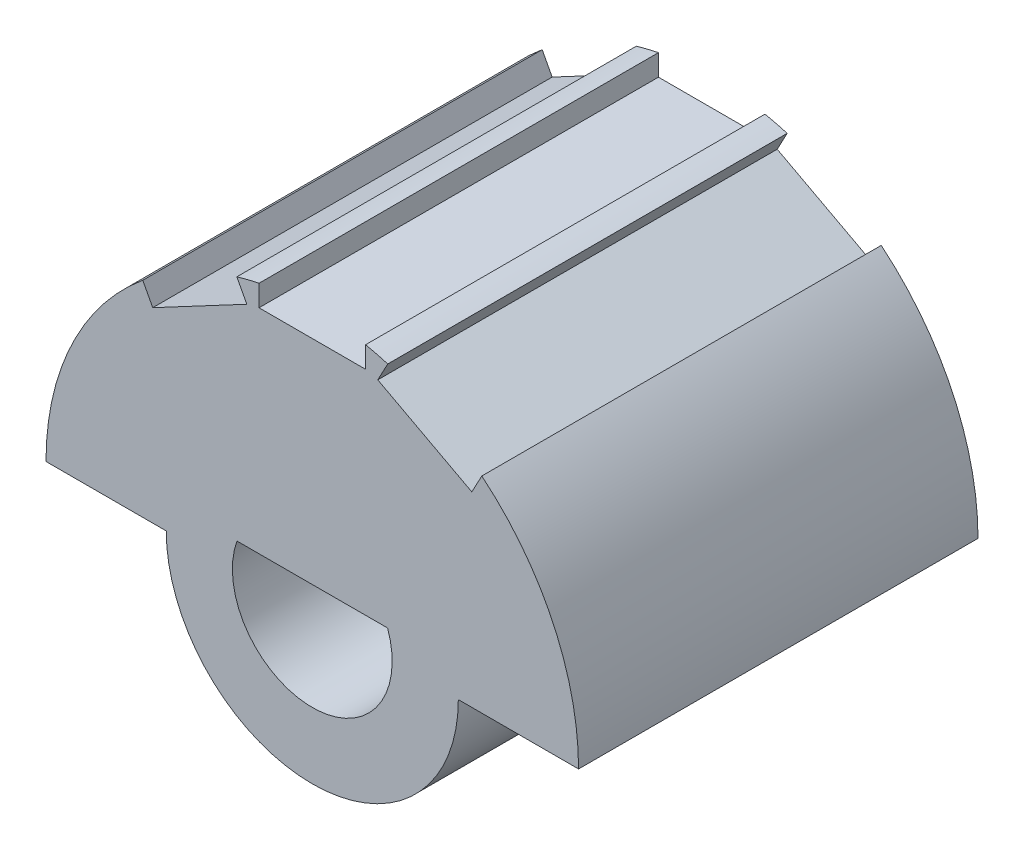
ISO-10303-21;
HEADER;
FILE_DESCRIPTION(('STEP AP214'),'2;1');
FILE_NAME('part.step','',(''),(''),'','','');
FILE_SCHEMA(('AUTOMOTIVE_DESIGN { 1 0 10303 214 1 1 1 1 }'));
ENDSEC;
DATA;
#1=APPLICATION_CONTEXT('core data for automotive mechanical design processes');
#2=APPLICATION_PROTOCOL_DEFINITION('international standard','automotive_design',2000,#1);
#3=PRODUCT_CONTEXT('',#1,'mechanical');
#4=PRODUCT('Part','Part','',(#3));
#5=PRODUCT_RELATED_PRODUCT_CATEGORY('part','',(#4));
#6=PRODUCT_DEFINITION_FORMATION('','',#4);
#7=PRODUCT_DEFINITION_CONTEXT('part definition',#1,'design');
#8=PRODUCT_DEFINITION('design','',#6,#7);
#9=PRODUCT_DEFINITION_SHAPE('','',#8);
#10=(LENGTH_UNIT() NAMED_UNIT(*) SI_UNIT(.MILLI.,.METRE.));
#11=(NAMED_UNIT(*) PLANE_ANGLE_UNIT() SI_UNIT($,.RADIAN.));
#12=(NAMED_UNIT(*) SI_UNIT($,.STERADIAN.) SOLID_ANGLE_UNIT());
#13=UNCERTAINTY_MEASURE_WITH_UNIT(LENGTH_MEASURE(1.E-05),#10,'distance_accuracy_value','');
#14=(GEOMETRIC_REPRESENTATION_CONTEXT(3) GLOBAL_UNCERTAINTY_ASSIGNED_CONTEXT((#13)) GLOBAL_UNIT_ASSIGNED_CONTEXT((#10,
#11,#12)) REPRESENTATION_CONTEXT('',''));
#15=CARTESIAN_POINT('',(0.,0.,0.));
#16=DIRECTION('',(0.,0.,1.));
#17=DIRECTION('',(1.,0.,0.));
#18=AXIS2_PLACEMENT_3D('',#15,#16,#17);
#19=CARTESIAN_POINT('',(0.,0.,0.));
#20=DIRECTION('',(0.,0.,1.));
#21=DIRECTION('',(1.,0.,0.));
#22=AXIS2_PLACEMENT_3D('',#19,#20,#21);
#23=CYLINDRICAL_SURFACE('',#22,10.);
#24=DIRECTION('',(0.,0.,1.));
#25=VECTOR('',#24,1.);
#26=CARTESIAN_POINT('',(2.83396792457184,9.59002741406395,0.));
#27=LINE('',#26,#25);
#28=CARTESIAN_POINT('',(2.83396792457184,9.59002741406394,15.));
#29=VERTEX_POINT('',#28);
#30=CARTESIAN_POINT('',(2.83396792457184,9.59002741406394,0.));
#31=VERTEX_POINT('',#30);
#32=EDGE_CURVE('E169',#29,#31,#27,.F.);
#33=ORIENTED_EDGE('',*,*,#32,.T.);
#34=CARTESIAN_POINT('',(0.,0.,0.));
#35=DIRECTION('',(0.,0.,1.));
#36=DIRECTION('',(1.,0.,0.));
#37=AXIS2_PLACEMENT_3D('',#34,#35,#36);
#38=CIRCLE('',#37,10.);
#39=CARTESIAN_POINT('',(2.,9.79795897113271,0.));
#40=VERTEX_POINT('',#39);
#41=EDGE_CURVE('E123',#31,#40,#38,.T.);
#42=ORIENTED_EDGE('',*,*,#41,.T.);
#43=DIRECTION('',(0.,0.,1.));
#44=VECTOR('',#43,1.);
#45=CARTESIAN_POINT('',(2.,9.79795897113271,0.));
#46=LINE('',#45,#44);
#47=CARTESIAN_POINT('',(2.,9.79795897113271,15.));
#48=VERTEX_POINT('',#47);
#49=EDGE_CURVE('E126',#40,#48,#46,.T.);
#50=ORIENTED_EDGE('',*,*,#49,.T.);
#51=CARTESIAN_POINT('',(0.,0.,15.));
#52=DIRECTION('',(0.,0.,1.));
#53=DIRECTION('',(1.,0.,0.));
#54=AXIS2_PLACEMENT_3D('',#51,#52,#53);
#55=CIRCLE('',#54,10.);
#56=EDGE_CURVE('E20',#48,#29,#55,.F.);
#57=ORIENTED_EDGE('',*,*,#56,.T.);
#58=EDGE_LOOP('',(#33,#42,#50,#57));
#59=FACE_BOUND('',#58,.T.);
#60=ADVANCED_FACE('F17',(#59),#23,.T.);
#61=CARTESIAN_POINT('',(0.,0.,0.));
#62=DIRECTION('',(0.,0.,1.));
#63=DIRECTION('',(1.,0.,0.));
#64=AXIS2_PLACEMENT_3D('',#61,#62,#63);
#65=CYLINDRICAL_SURFACE('',#64,10.);
#66=DIRECTION('',(0.,0.,1.));
#67=VECTOR('',#66,1.);
#68=CARTESIAN_POINT('',(-2.83396792457185,9.59002741406394,0.));
#69=LINE('',#68,#67);
#70=CARTESIAN_POINT('',(-2.83396792457185,9.59002741406394,0.));
#71=VERTEX_POINT('',#70);
#72=CARTESIAN_POINT('',(-2.83396792457185,9.59002741406394,15.));
#73=VERTEX_POINT('',#72);
#74=EDGE_CURVE('E222',#71,#73,#69,.T.);
#75=ORIENTED_EDGE('',*,*,#74,.T.);
#76=CARTESIAN_POINT('',(0.,0.,15.));
#77=DIRECTION('',(0.,0.,1.));
#78=DIRECTION('',(1.,0.,0.));
#79=AXIS2_PLACEMENT_3D('',#76,#77,#78);
#80=CIRCLE('',#79,10.);
#81=CARTESIAN_POINT('',(-2.,9.79795897113271,15.));
#82=VERTEX_POINT('',#81);
#83=EDGE_CURVE('E182',#73,#82,#80,.F.);
#84=ORIENTED_EDGE('',*,*,#83,.T.);
#85=DIRECTION('',(0.,0.,1.));
#86=VECTOR('',#85,1.);
#87=CARTESIAN_POINT('',(-2.,9.79795897113272,0.));
#88=LINE('',#87,#86);
#89=CARTESIAN_POINT('',(-2.,9.79795897113271,0.));
#90=VERTEX_POINT('',#89);
#91=EDGE_CURVE('E140',#82,#90,#88,.F.);
#92=ORIENTED_EDGE('',*,*,#91,.T.);
#93=CARTESIAN_POINT('',(0.,0.,0.));
#94=DIRECTION('',(0.,0.,1.));
#95=DIRECTION('',(1.,0.,0.));
#96=AXIS2_PLACEMENT_3D('',#93,#94,#95);
#97=CIRCLE('',#96,10.);
#98=EDGE_CURVE('E216',#90,#71,#97,.T.);
#99=ORIENTED_EDGE('',*,*,#98,.T.);
#100=EDGE_LOOP('',(#75,#84,#92,#99));
#101=FACE_BOUND('',#100,.T.);
#102=ADVANCED_FACE('F221',(#101),#65,.T.);
#103=CARTESIAN_POINT('',(3.2021736247616,10.2825216191022,0.));
#104=DIRECTION('',(-0.882947592858927,0.469471562785891,0.));
#105=DIRECTION('',(-0.469471562785891,-0.882947592858927,0.));
#106=AXIS2_PLACEMENT_3D('',#103,#104,#105);
#107=PLANE('',#106);
#108=DIRECTION('',(-0.469471562785891,-0.882947592858927,0.));
#109=VECTOR('',#108,1.);
#110=CARTESIAN_POINT('',(3.2021736247616,10.2825216191022,0.));
#111=LINE('',#110,#109);
#112=CARTESIAN_POINT('',(2.45934887935515,8.88547146130213,0.));
#113=VERTEX_POINT('',#112);
#114=EDGE_CURVE('E166',#31,#113,#111,.T.);
#115=ORIENTED_EDGE('',*,*,#114,.F.);
#116=ORIENTED_EDGE('',*,*,#32,.F.);
#117=DIRECTION('',(-0.469471562785891,-0.882947592858927,0.));
#118=VECTOR('',#117,1.);
#119=CARTESIAN_POINT('',(3.2021736247616,10.2825216191022,15.));
#120=LINE('',#119,#118);
#121=CARTESIAN_POINT('',(2.45934887935515,8.88547146130213,15.));
#122=VERTEX_POINT('',#121);
#123=EDGE_CURVE('E119',#122,#29,#120,.F.);
#124=ORIENTED_EDGE('',*,*,#123,.F.);
#125=DIRECTION('',(0.,0.,1.));
#126=VECTOR('',#125,1.);
#127=CARTESIAN_POINT('',(2.45934887935515,8.88547146130213,0.));
#128=LINE('',#127,#126);
#129=EDGE_CURVE('E175',#122,#113,#128,.F.);
#130=ORIENTED_EDGE('',*,*,#129,.T.);
#131=EDGE_LOOP('',(#115,#116,#124,#130));
#132=FACE_BOUND('',#131,.T.);
#133=ADVANCED_FACE('F370',(#132),#107,.F.);
#134=CARTESIAN_POINT('',(-2.,10.5822571680347,0.));
#135=DIRECTION('',(-1.,0.,0.));
#136=DIRECTION('',(0.,-1.,0.));
#137=AXIS2_PLACEMENT_3D('',#134,#135,#136);
#138=PLANE('',#137);
#139=DIRECTION('',(0.,-1.,0.));
#140=VECTOR('',#139,1.);
#141=CARTESIAN_POINT('',(-2.,10.5822571680347,0.));
#142=LINE('',#141,#140);
#143=CARTESIAN_POINT('',(-2.,9.,0.));
#144=VERTEX_POINT('',#143);
#145=EDGE_CURVE('E136',#90,#144,#142,.T.);
#146=ORIENTED_EDGE('',*,*,#145,.F.);
#147=ORIENTED_EDGE('',*,*,#91,.F.);
#148=DIRECTION('',(0.,-1.,0.));
#149=VECTOR('',#148,1.);
#150=CARTESIAN_POINT('',(-2.,10.5822571680347,15.));
#151=LINE('',#150,#149);
#152=CARTESIAN_POINT('',(-2.,9.,15.));
#153=VERTEX_POINT('',#152);
#154=EDGE_CURVE('E155',#153,#82,#151,.F.);
#155=ORIENTED_EDGE('',*,*,#154,.F.);
#156=DIRECTION('',(0.,0.,-1.));
#157=VECTOR('',#156,1.);
#158=CARTESIAN_POINT('',(-2.,9.,0.));
#159=LINE('',#158,#157);
#160=EDGE_CURVE('E159',#153,#144,#159,.T.);
#161=ORIENTED_EDGE('',*,*,#160,.T.);
#162=EDGE_LOOP('',(#146,#147,#155,#161));
#163=FACE_BOUND('',#162,.T.);
#164=ADVANCED_FACE('F373',(#163),#138,.F.);
#165=CARTESIAN_POINT('',(2.,9.,0.));
#166=DIRECTION('',(1.,0.,0.));
#167=DIRECTION('',(0.,1.,0.));
#168=AXIS2_PLACEMENT_3D('',#165,#166,#167);
#169=PLANE('',#168);
#170=DIRECTION('',(0.,1.,0.));
#171=VECTOR('',#170,1.);
#172=CARTESIAN_POINT('',(2.,9.,0.));
#173=LINE('',#172,#171);
#174=CARTESIAN_POINT('',(2.,9.,0.));
#175=VERTEX_POINT('',#174);
#176=EDGE_CURVE('E130',#175,#40,#173,.T.);
#177=ORIENTED_EDGE('',*,*,#176,.F.);
#178=DIRECTION('',(0.,0.,-1.));
#179=VECTOR('',#178,1.);
#180=CARTESIAN_POINT('',(2.,9.,0.));
#181=LINE('',#180,#179);
#182=CARTESIAN_POINT('',(2.,9.,15.));
#183=VERTEX_POINT('',#182);
#184=EDGE_CURVE('E134',#175,#183,#181,.F.);
#185=ORIENTED_EDGE('',*,*,#184,.T.);
#186=DIRECTION('',(0.,1.,0.));
#187=VECTOR('',#186,1.);
#188=CARTESIAN_POINT('',(2.,9.,15.));
#189=LINE('',#188,#187);
#190=EDGE_CURVE('E115',#48,#183,#189,.F.);
#191=ORIENTED_EDGE('',*,*,#190,.F.);
#192=ORIENTED_EDGE('',*,*,#49,.F.);
#193=EDGE_LOOP('',(#177,#185,#191,#192));
#194=FACE_BOUND('',#193,.T.);
#195=ADVANCED_FACE('F132',(#194),#169,.F.);
#196=CARTESIAN_POINT('',(-2.45934887935516,8.88547146130213,0.));
#197=DIRECTION('',(0.882947592858927,0.469471562785891,0.));
#198=DIRECTION('',(-0.469471562785891,0.882947592858927,0.));
#199=AXIS2_PLACEMENT_3D('',#196,#197,#198);
#200=PLANE('',#199);
#201=DIRECTION('',(-0.469471562785891,0.882947592858927,0.));
#202=VECTOR('',#201,1.);
#203=CARTESIAN_POINT('',(-2.45934887935516,8.88547146130213,0.));
#204=LINE('',#203,#202);
#205=CARTESIAN_POINT('',(-2.45934887935516,8.88547146130213,0.));
#206=VERTEX_POINT('',#205);
#207=EDGE_CURVE('E231',#206,#71,#204,.T.);
#208=ORIENTED_EDGE('',*,*,#207,.F.);
#209=DIRECTION('',(0.,0.,1.));
#210=VECTOR('',#209,1.);
#211=CARTESIAN_POINT('',(-2.45934887935516,8.88547146130213,0.));
#212=LINE('',#211,#210);
#213=CARTESIAN_POINT('',(-2.45934887935516,8.88547146130213,15.));
#214=VERTEX_POINT('',#213);
#215=EDGE_CURVE('E242',#206,#214,#212,.T.);
#216=ORIENTED_EDGE('',*,*,#215,.T.);
#217=DIRECTION('',(-0.469471562785891,0.882947592858927,0.));
#218=VECTOR('',#217,1.);
#219=CARTESIAN_POINT('',(-2.45934887935516,8.88547146130213,15.));
#220=LINE('',#219,#218);
#221=EDGE_CURVE('E129',#73,#214,#220,.F.);
#222=ORIENTED_EDGE('',*,*,#221,.F.);
#223=ORIENTED_EDGE('',*,*,#74,.F.);
#224=EDGE_LOOP('',(#208,#216,#222,#223));
#225=FACE_BOUND('',#224,.T.);
#226=ADVANCED_FACE('F228',(#225),#200,.F.);
#227=CARTESIAN_POINT('',(-6.73396399619731,8.4046353679586,0.));
#228=DIRECTION('',(-0.882947592858927,-0.46947156278589,0.));
#229=DIRECTION('',(0.46947156278589,-0.882947592858927,0.));
#230=AXIS2_PLACEMENT_3D('',#227,#228,#229);
#231=PLANE('',#230);
#232=DIRECTION('',(0.46947156278589,-0.882947592858927,0.));
#233=VECTOR('',#232,1.);
#234=CARTESIAN_POINT('',(-6.73396399619731,8.4046353679586,0.));
#235=LINE('',#234,#233);
#236=CARTESIAN_POINT('',(-6.36575829600757,7.71214116292038,0.));
#237=VERTEX_POINT('',#236);
#238=CARTESIAN_POINT('',(-5.99113925079087,7.00758521015856,0.));
#239=VERTEX_POINT('',#238);
#240=EDGE_CURVE('E236',#237,#239,#235,.T.);
#241=ORIENTED_EDGE('',*,*,#240,.F.);
#242=DIRECTION('',(0.,0.,1.));
#243=VECTOR('',#242,1.);
#244=CARTESIAN_POINT('',(-6.36575829600757,7.71214116292038,0.));
#245=LINE('',#244,#243);
#246=CARTESIAN_POINT('',(-6.36575829600757,7.71214116292038,15.));
#247=VERTEX_POINT('',#246);
#248=EDGE_CURVE('E244',#247,#237,#245,.F.);
#249=ORIENTED_EDGE('',*,*,#248,.F.);
#250=DIRECTION('',(0.46947156278589,-0.882947592858927,0.));
#251=VECTOR('',#250,1.);
#252=CARTESIAN_POINT('',(-6.73396399619731,8.4046353679586,15.));
#253=LINE('',#252,#251);
#254=CARTESIAN_POINT('',(-5.99113925079087,7.00758521015856,15.));
#255=VERTEX_POINT('',#254);
#256=EDGE_CURVE('E234',#255,#247,#253,.F.);
#257=ORIENTED_EDGE('',*,*,#256,.F.);
#258=DIRECTION('',(0.,0.,1.));
#259=VECTOR('',#258,1.);
#260=CARTESIAN_POINT('',(-5.99113925079087,7.00758521015856,0.));
#261=LINE('',#260,#259);
#262=EDGE_CURVE('E245',#255,#239,#261,.F.);
#263=ORIENTED_EDGE('',*,*,#262,.T.);
#264=EDGE_LOOP('',(#241,#249,#257,#263));
#265=FACE_BOUND('',#264,.T.);
#266=ADVANCED_FACE('F323',(#265),#231,.F.);
#267=CARTESIAN_POINT('',(5.99113925079087,7.00758521015856,0.));
#268=DIRECTION('',(0.882947592858927,-0.469471562785891,0.));
#269=DIRECTION('',(0.469471562785891,0.882947592858927,0.));
#270=AXIS2_PLACEMENT_3D('',#267,#268,#269);
#271=PLANE('',#270);
#272=DIRECTION('',(0.469471562785891,0.882947592858927,0.));
#273=VECTOR('',#272,1.);
#274=CARTESIAN_POINT('',(5.99113925079087,7.00758521015856,0.));
#275=LINE('',#274,#273);
#276=CARTESIAN_POINT('',(5.99113925079087,7.00758521015856,0.));
#277=VERTEX_POINT('',#276);
#278=CARTESIAN_POINT('',(6.36575829600757,7.71214116292037,0.));
#279=VERTEX_POINT('',#278);
#280=EDGE_CURVE('E351',#277,#279,#275,.T.);
#281=ORIENTED_EDGE('',*,*,#280,.F.);
#282=DIRECTION('',(0.,0.,1.));
#283=VECTOR('',#282,1.);
#284=CARTESIAN_POINT('',(5.99113925079087,7.00758521015856,0.));
#285=LINE('',#284,#283);
#286=CARTESIAN_POINT('',(5.99113925079087,7.00758521015856,15.));
#287=VERTEX_POINT('',#286);
#288=EDGE_CURVE('E162',#277,#287,#285,.T.);
#289=ORIENTED_EDGE('',*,*,#288,.T.);
#290=DIRECTION('',(0.469471562785891,0.882947592858927,0.));
#291=VECTOR('',#290,1.);
#292=CARTESIAN_POINT('',(5.99113925079087,7.00758521015856,15.));
#293=LINE('',#292,#291);
#294=CARTESIAN_POINT('',(6.36575829600757,7.71214116292037,15.));
#295=VERTEX_POINT('',#294);
#296=EDGE_CURVE('E311',#295,#287,#293,.F.);
#297=ORIENTED_EDGE('',*,*,#296,.F.);
#298=DIRECTION('',(0.,0.,1.));
#299=VECTOR('',#298,1.);
#300=CARTESIAN_POINT('',(6.36575829600757,7.71214116292037,0.));
#301=LINE('',#300,#299);
#302=EDGE_CURVE('E326',#279,#295,#301,.T.);
#303=ORIENTED_EDGE('',*,*,#302,.F.);
#304=EDGE_LOOP('',(#281,#289,#297,#303));
#305=FACE_BOUND('',#304,.T.);
#306=ADVANCED_FACE('F366',(#305),#271,.F.);
#307=CARTESIAN_POINT('',(0.,0.,0.));
#308=DIRECTION('',(0.,0.,1.));
#309=DIRECTION('',(1.,0.,0.));
#310=AXIS2_PLACEMENT_3D('',#307,#308,#309);
#311=CYLINDRICAL_SURFACE('',#310,3.);
#312=CARTESIAN_POINT('',(0.,0.,0.));
#313=DIRECTION('',(0.,0.,1.));
#314=DIRECTION('',(1.,0.,0.));
#315=AXIS2_PLACEMENT_3D('',#312,#313,#314);
#316=CIRCLE('',#315,3.);
#317=CARTESIAN_POINT('',(2.82842712474619,1.,0.));
#318=VERTEX_POINT('',#317);
#319=CARTESIAN_POINT('',(-2.82842712474619,1.,0.));
#320=VERTEX_POINT('',#319);
#321=EDGE_CURVE('E201',#318,#320,#316,.F.);
#322=ORIENTED_EDGE('',*,*,#321,.T.);
#323=DIRECTION('',(0.,0.,1.));
#324=VECTOR('',#323,1.);
#325=CARTESIAN_POINT('',(-2.82842712474619,1.,0.));
#326=LINE('',#325,#324);
#327=CARTESIAN_POINT('',(-2.82842712474619,1.,15.));
#328=VERTEX_POINT('',#327);
#329=EDGE_CURVE('E348',#320,#328,#326,.T.);
#330=ORIENTED_EDGE('',*,*,#329,.T.);
#331=CARTESIAN_POINT('',(0.,0.,15.));
#332=DIRECTION('',(0.,0.,1.));
#333=DIRECTION('',(1.,0.,0.));
#334=AXIS2_PLACEMENT_3D('',#331,#332,#333);
#335=CIRCLE('',#334,3.);
#336=CARTESIAN_POINT('',(2.82842712474619,1.,15.));
#337=VERTEX_POINT('',#336);
#338=EDGE_CURVE('E211',#337,#328,#335,.F.);
#339=ORIENTED_EDGE('',*,*,#338,.F.);
#340=DIRECTION('',(0.,0.,1.));
#341=VECTOR('',#340,1.);
#342=CARTESIAN_POINT('',(2.82842712474619,1.,0.));
#343=LINE('',#342,#341);
#344=EDGE_CURVE('E178',#337,#318,#343,.F.);
#345=ORIENTED_EDGE('',*,*,#344,.T.);
#346=EDGE_LOOP('',(#322,#330,#339,#345));
#347=FACE_BOUND('',#346,.T.);
#348=ADVANCED_FACE('F415',(#347),#311,.F.);
#349=CARTESIAN_POINT('',(2.82842712474619,1.,0.));
#350=DIRECTION('',(0.,1.,0.));
#351=DIRECTION('',(0.,0.,1.));
#352=AXIS2_PLACEMENT_3D('',#349,#350,#351);
#353=PLANE('',#352);
#354=DIRECTION('',(1.,0.,0.));
#355=VECTOR('',#354,1.);
#356=CARTESIAN_POINT('',(0.,1.,15.));
#357=LINE('',#356,#355);
#358=EDGE_CURVE('E213',#328,#337,#357,.T.);
#359=ORIENTED_EDGE('',*,*,#358,.F.);
#360=ORIENTED_EDGE('',*,*,#329,.F.);
#361=DIRECTION('',(1.,0.,0.));
#362=VECTOR('',#361,1.);
#363=CARTESIAN_POINT('',(0.,1.,0.));
#364=LINE('',#363,#362);
#365=EDGE_CURVE('E200',#320,#318,#364,.T.);
#366=ORIENTED_EDGE('',*,*,#365,.T.);
#367=ORIENTED_EDGE('',*,*,#344,.F.);
#368=EDGE_LOOP('',(#359,#360,#366,#367));
#369=FACE_BOUND('',#368,.T.);
#370=ADVANCED_FACE('F412',(#369),#353,.F.);
#371=CARTESIAN_POINT('',(2.45934887935517,8.88547146130212,0.));
#372=DIRECTION('',(-0.469471562785891,-0.882947592858927,0.));
#373=DIRECTION('',(0.882947592858927,-0.469471562785891,0.));
#374=AXIS2_PLACEMENT_3D('',#371,#372,#373);
#375=PLANE('',#374);
#376=DIRECTION('',(-0.882947592858927,0.469471562785891,0.));
#377=VECTOR('',#376,1.);
#378=CARTESIAN_POINT('',(5.99113925079087,7.00758521015856,0.));
#379=LINE('',#378,#377);
#380=EDGE_CURVE('E199',#277,#113,#379,.T.);
#381=ORIENTED_EDGE('',*,*,#380,.T.);
#382=ORIENTED_EDGE('',*,*,#129,.F.);
#383=DIRECTION('',(-0.882947592858927,0.469471562785891,0.));
#384=VECTOR('',#383,1.);
#385=CARTESIAN_POINT('',(5.99113925079087,7.00758521015856,15.));
#386=LINE('',#385,#384);
#387=EDGE_CURVE('E151',#287,#122,#386,.T.);
#388=ORIENTED_EDGE('',*,*,#387,.F.);
#389=ORIENTED_EDGE('',*,*,#288,.F.);
#390=EDGE_LOOP('',(#381,#382,#388,#389));
#391=FACE_BOUND('',#390,.T.);
#392=ADVANCED_FACE('F368',(#391),#375,.F.);
#393=CARTESIAN_POINT('',(-2.,9.,0.));
#394=DIRECTION('',(0.,-1.,0.));
#395=DIRECTION('',(0.,0.,-1.));
#396=AXIS2_PLACEMENT_3D('',#393,#394,#395);
#397=PLANE('',#396);
#398=DIRECTION('',(1.,0.,0.));
#399=VECTOR('',#398,1.);
#400=CARTESIAN_POINT('',(0.,9.,0.));
#401=LINE('',#400,#399);
#402=EDGE_CURVE('E255',#175,#144,#401,.F.);
#403=ORIENTED_EDGE('',*,*,#402,.T.);
#404=ORIENTED_EDGE('',*,*,#160,.F.);
#405=DIRECTION('',(1.,0.,0.));
#406=VECTOR('',#405,1.);
#407=CARTESIAN_POINT('',(0.,9.,15.));
#408=LINE('',#407,#406);
#409=EDGE_CURVE('E148',#183,#153,#408,.F.);
#410=ORIENTED_EDGE('',*,*,#409,.F.);
#411=ORIENTED_EDGE('',*,*,#184,.F.);
#412=EDGE_LOOP('',(#403,#404,#410,#411));
#413=FACE_BOUND('',#412,.T.);
#414=ADVANCED_FACE('F371',(#413),#397,.F.);
#415=CARTESIAN_POINT('',(-5.99113925079087,7.00758521015856,0.));
#416=DIRECTION('',(0.469471562785891,-0.882947592858927,0.));
#417=DIRECTION('',(0.882947592858927,0.469471562785891,0.));
#418=AXIS2_PLACEMENT_3D('',#415,#416,#417);
#419=PLANE('',#418);
#420=DIRECTION('',(-0.882947592858926,-0.469471562785891,0.));
#421=VECTOR('',#420,1.);
#422=CARTESIAN_POINT('',(-2.45934887935516,8.88547146130213,0.));
#423=LINE('',#422,#421);
#424=EDGE_CURVE('E195',#206,#239,#423,.T.);
#425=ORIENTED_EDGE('',*,*,#424,.T.);
#426=ORIENTED_EDGE('',*,*,#262,.F.);
#427=DIRECTION('',(-0.882947592858927,-0.469471562785891,0.));
#428=VECTOR('',#427,1.);
#429=CARTESIAN_POINT('',(-2.45934887935516,8.88547146130213,15.));
#430=LINE('',#429,#428);
#431=EDGE_CURVE('E150',#214,#255,#430,.T.);
#432=ORIENTED_EDGE('',*,*,#431,.F.);
#433=ORIENTED_EDGE('',*,*,#215,.F.);
#434=EDGE_LOOP('',(#425,#426,#432,#433));
#435=FACE_BOUND('',#434,.T.);
#436=ADVANCED_FACE('F295',(#435),#419,.F.);
#437=CARTESIAN_POINT('',(0.,0.,0.));
#438=DIRECTION('',(0.,0.,1.));
#439=DIRECTION('',(1.,0.,0.));
#440=AXIS2_PLACEMENT_3D('',#437,#438,#439);
#441=CYLINDRICAL_SURFACE('',#440,10.);
#442=DIRECTION('',(0.,0.,1.));
#443=VECTOR('',#442,1.);
#444=CARTESIAN_POINT('',(-10.,0.,0.));
#445=LINE('',#444,#443);
#446=CARTESIAN_POINT('',(-10.,0.,0.));
#447=VERTEX_POINT('',#446);
#448=CARTESIAN_POINT('',(-10.,0.,15.));
#449=VERTEX_POINT('',#448);
#450=EDGE_CURVE('E207',#447,#449,#445,.T.);
#451=ORIENTED_EDGE('',*,*,#450,.T.);
#452=CARTESIAN_POINT('',(0.,0.,15.));
#453=DIRECTION('',(0.,0.,1.));
#454=DIRECTION('',(1.,0.,0.));
#455=AXIS2_PLACEMENT_3D('',#452,#453,#454);
#456=CIRCLE('',#455,10.);
#457=EDGE_CURVE('E204',#247,#449,#456,.T.);
#458=ORIENTED_EDGE('',*,*,#457,.F.);
#459=ORIENTED_EDGE('',*,*,#248,.T.);
#460=CARTESIAN_POINT('',(0.,0.,0.));
#461=DIRECTION('',(0.,0.,1.));
#462=DIRECTION('',(1.,0.,0.));
#463=AXIS2_PLACEMENT_3D('',#460,#461,#462);
#464=CIRCLE('',#463,10.);
#465=EDGE_CURVE('E192',#237,#447,#464,.T.);
#466=ORIENTED_EDGE('',*,*,#465,.T.);
#467=EDGE_LOOP('',(#451,#458,#459,#466));
#468=FACE_BOUND('',#467,.T.);
#469=ADVANCED_FACE('F328',(#468),#441,.T.);
#470=CARTESIAN_POINT('',(0.,0.,0.));
#471=DIRECTION('',(0.,0.,1.));
#472=DIRECTION('',(1.,0.,0.));
#473=AXIS2_PLACEMENT_3D('',#470,#471,#472);
#474=CYLINDRICAL_SURFACE('',#473,10.);
#475=DIRECTION('',(0.,0.,1.));
#476=VECTOR('',#475,1.);
#477=CARTESIAN_POINT('',(10.,0.,0.));
#478=LINE('',#477,#476);
#479=CARTESIAN_POINT('',(10.,0.,15.));
#480=VERTEX_POINT('',#479);
#481=CARTESIAN_POINT('',(10.,0.,0.));
#482=VERTEX_POINT('',#481);
#483=EDGE_CURVE('E191',#480,#482,#478,.F.);
#484=ORIENTED_EDGE('',*,*,#483,.T.);
#485=CARTESIAN_POINT('',(0.,0.,0.));
#486=DIRECTION('',(0.,0.,1.));
#487=DIRECTION('',(1.,0.,0.));
#488=AXIS2_PLACEMENT_3D('',#485,#486,#487);
#489=CIRCLE('',#488,10.);
#490=EDGE_CURVE('E196',#482,#279,#489,.T.);
#491=ORIENTED_EDGE('',*,*,#490,.T.);
#492=ORIENTED_EDGE('',*,*,#302,.T.);
#493=CARTESIAN_POINT('',(0.,0.,15.));
#494=DIRECTION('',(0.,0.,1.));
#495=DIRECTION('',(1.,0.,0.));
#496=AXIS2_PLACEMENT_3D('',#493,#494,#495);
#497=CIRCLE('',#496,10.);
#498=EDGE_CURVE('E208',#480,#295,#497,.T.);
#499=ORIENTED_EDGE('',*,*,#498,.F.);
#500=EDGE_LOOP('',(#484,#491,#492,#499));
#501=FACE_BOUND('',#500,.T.);
#502=ADVANCED_FACE('F400',(#501),#474,.T.);
#503=CARTESIAN_POINT('',(0.,0.,15.));
#504=DIRECTION('',(0.,0.,1.));
#505=DIRECTION('',(1.,0.,0.));
#506=AXIS2_PLACEMENT_3D('',#503,#504,#505);
#507=PLANE('',#506);
#508=ORIENTED_EDGE('',*,*,#256,.T.);
#509=ORIENTED_EDGE('',*,*,#457,.T.);
#510=DIRECTION('',(1.,0.,0.));
#511=VECTOR('',#510,1.);
#512=CARTESIAN_POINT('',(-5.48440588197191,0.,15.));
#513=LINE('',#512,#511);
#514=CARTESIAN_POINT('',(-5.48440588197191,0.,15.));
#515=VERTEX_POINT('',#514);
#516=EDGE_CURVE('E203',#449,#515,#513,.T.);
#517=ORIENTED_EDGE('',*,*,#516,.T.);
#518=CARTESIAN_POINT('',(0.,0.,15.));
#519=DIRECTION('',(0.,0.,1.));
#520=DIRECTION('',(1.,0.,0.));
#521=AXIS2_PLACEMENT_3D('',#518,#519,#520);
#522=CIRCLE('',#521,5.48440588197191);
#523=CARTESIAN_POINT('',(5.48440588197191,0.,15.));
#524=VERTEX_POINT('',#523);
#525=EDGE_CURVE('E188',#524,#515,#522,.F.);
#526=ORIENTED_EDGE('',*,*,#525,.F.);
#527=DIRECTION('',(-1.,0.,0.));
#528=VECTOR('',#527,1.);
#529=CARTESIAN_POINT('',(10.,0.,15.));
#530=LINE('',#529,#528);
#531=EDGE_CURVE('E341',#524,#480,#530,.F.);
#532=ORIENTED_EDGE('',*,*,#531,.T.);
#533=ORIENTED_EDGE('',*,*,#498,.T.);
#534=ORIENTED_EDGE('',*,*,#296,.T.);
#535=ORIENTED_EDGE('',*,*,#387,.T.);
#536=ORIENTED_EDGE('',*,*,#123,.T.);
#537=ORIENTED_EDGE('',*,*,#56,.F.);
#538=ORIENTED_EDGE('',*,*,#190,.T.);
#539=ORIENTED_EDGE('',*,*,#409,.T.);
#540=ORIENTED_EDGE('',*,*,#154,.T.);
#541=ORIENTED_EDGE('',*,*,#83,.F.);
#542=ORIENTED_EDGE('',*,*,#221,.T.);
#543=ORIENTED_EDGE('',*,*,#431,.T.);
#544=EDGE_LOOP('',(#508,#509,#517,#526,#532,#533,#534,#535,#536,#537,#538,#539,#540,#541,#542,#543));
#545=FACE_BOUND('',#544,.T.);
#546=ORIENTED_EDGE('',*,*,#338,.T.);
#547=ORIENTED_EDGE('',*,*,#358,.T.);
#548=EDGE_LOOP('',(#546,#547));
#549=FACE_BOUND('',#548,.T.);
#550=ADVANCED_FACE('F110',(#545,#549),#507,.T.);
#551=CARTESIAN_POINT('',(-5.48440588197191,0.,0.));
#552=DIRECTION('',(0.,1.,0.));
#553=DIRECTION('',(0.,0.,1.));
#554=AXIS2_PLACEMENT_3D('',#551,#552,#553);
#555=PLANE('',#554);
#556=ORIENTED_EDGE('',*,*,#516,.F.);
#557=ORIENTED_EDGE('',*,*,#450,.F.);
#558=DIRECTION('',(1.,0.,0.));
#559=VECTOR('',#558,1.);
#560=CARTESIAN_POINT('',(0.,0.,0.));
#561=LINE('',#560,#559);
#562=CARTESIAN_POINT('',(-5.48440588197191,0.,0.));
#563=VERTEX_POINT('',#562);
#564=EDGE_CURVE('E194',#447,#563,#561,.T.);
#565=ORIENTED_EDGE('',*,*,#564,.T.);
#566=DIRECTION('',(0.,0.,1.));
#567=VECTOR('',#566,1.);
#568=CARTESIAN_POINT('',(-5.48440588197191,0.,0.));
#569=LINE('',#568,#567);
#570=EDGE_CURVE('E187',#515,#563,#569,.F.);
#571=ORIENTED_EDGE('',*,*,#570,.F.);
#572=EDGE_LOOP('',(#556,#557,#565,#571));
#573=FACE_BOUND('',#572,.T.);
#574=ADVANCED_FACE('F333',(#573),#555,.F.);
#575=CARTESIAN_POINT('',(0.,0.,0.));
#576=DIRECTION('',(0.,0.,1.));
#577=DIRECTION('',(1.,0.,0.));
#578=AXIS2_PLACEMENT_3D('',#575,#576,#577);
#579=PLANE('',#578);
#580=ORIENTED_EDGE('',*,*,#564,.F.);
#581=ORIENTED_EDGE('',*,*,#465,.F.);
#582=ORIENTED_EDGE('',*,*,#240,.T.);
#583=ORIENTED_EDGE('',*,*,#424,.F.);
#584=ORIENTED_EDGE('',*,*,#207,.T.);
#585=ORIENTED_EDGE('',*,*,#98,.F.);
#586=ORIENTED_EDGE('',*,*,#145,.T.);
#587=ORIENTED_EDGE('',*,*,#402,.F.);
#588=ORIENTED_EDGE('',*,*,#176,.T.);
#589=ORIENTED_EDGE('',*,*,#41,.F.);
#590=ORIENTED_EDGE('',*,*,#114,.T.);
#591=ORIENTED_EDGE('',*,*,#380,.F.);
#592=ORIENTED_EDGE('',*,*,#280,.T.);
#593=ORIENTED_EDGE('',*,*,#490,.F.);
#594=DIRECTION('',(-1.,0.,0.));
#595=VECTOR('',#594,1.);
#596=CARTESIAN_POINT('',(10.,0.,0.));
#597=LINE('',#596,#595);
#598=CARTESIAN_POINT('',(5.48440588197191,0.,0.));
#599=VERTEX_POINT('',#598);
#600=EDGE_CURVE('E35',#482,#599,#597,.T.);
#601=ORIENTED_EDGE('',*,*,#600,.T.);
#602=CARTESIAN_POINT('',(0.,0.,0.));
#603=DIRECTION('',(0.,0.,1.));
#604=DIRECTION('',(1.,0.,0.));
#605=AXIS2_PLACEMENT_3D('',#602,#603,#604);
#606=CIRCLE('',#605,5.48440588197191);
#607=EDGE_CURVE('E26',#563,#599,#606,.T.);
#608=ORIENTED_EDGE('',*,*,#607,.F.);
#609=EDGE_LOOP('',(#580,#581,#582,#583,#584,#585,#586,#587,#588,#589,#590,#591,#592,#593,#601,#608));
#610=FACE_BOUND('',#609,.T.);
#611=ORIENTED_EDGE('',*,*,#365,.F.);
#612=ORIENTED_EDGE('',*,*,#321,.F.);
#613=EDGE_LOOP('',(#611,#612));
#614=FACE_BOUND('',#613,.T.);
#615=ADVANCED_FACE('F318',(#610,#614),#579,.F.);
#616=CARTESIAN_POINT('',(10.,0.,0.));
#617=DIRECTION('',(0.,1.,0.));
#618=DIRECTION('',(-1.,0.,0.));
#619=AXIS2_PLACEMENT_3D('',#616,#617,#618);
#620=PLANE('',#619);
#621=ORIENTED_EDGE('',*,*,#531,.F.);
#622=DIRECTION('',(0.,0.,1.));
#623=VECTOR('',#622,1.);
#624=CARTESIAN_POINT('',(5.48440588197191,0.,0.));
#625=LINE('',#624,#623);
#626=EDGE_CURVE('E11',#599,#524,#625,.T.);
#627=ORIENTED_EDGE('',*,*,#626,.F.);
#628=ORIENTED_EDGE('',*,*,#600,.F.);
#629=ORIENTED_EDGE('',*,*,#483,.F.);
#630=EDGE_LOOP('',(#621,#627,#628,#629));
#631=FACE_BOUND('',#630,.T.);
#632=ADVANCED_FACE('F385',(#631),#620,.F.);
#633=CARTESIAN_POINT('',(0.,0.,0.));
#634=DIRECTION('',(0.,0.,1.));
#635=DIRECTION('',(1.,0.,0.));
#636=AXIS2_PLACEMENT_3D('',#633,#634,#635);
#637=CYLINDRICAL_SURFACE('',#636,5.48440588197191);
#638=ORIENTED_EDGE('',*,*,#607,.T.);
#639=ORIENTED_EDGE('',*,*,#626,.T.);
#640=ORIENTED_EDGE('',*,*,#525,.T.);
#641=ORIENTED_EDGE('',*,*,#570,.T.);
#642=EDGE_LOOP('',(#638,#639,#640,#641));
#643=FACE_BOUND('',#642,.T.);
#644=ADVANCED_FACE('F383',(#643),#637,.T.);
#645=CLOSED_SHELL('',(#60,#102,#133,#164,#195,#226,#266,#306,#348,#370,#392,#414,#436,#469,#502,
#550,#574,#615,#632,#644));
#646=MANIFOLD_SOLID_BREP('B1',#645);
#647=ADVANCED_BREP_SHAPE_REPRESENTATION('',(#18,#646),#14);
#648=SHAPE_DEFINITION_REPRESENTATION(#9,#647);
ENDSEC;
END-ISO-10303-21;
